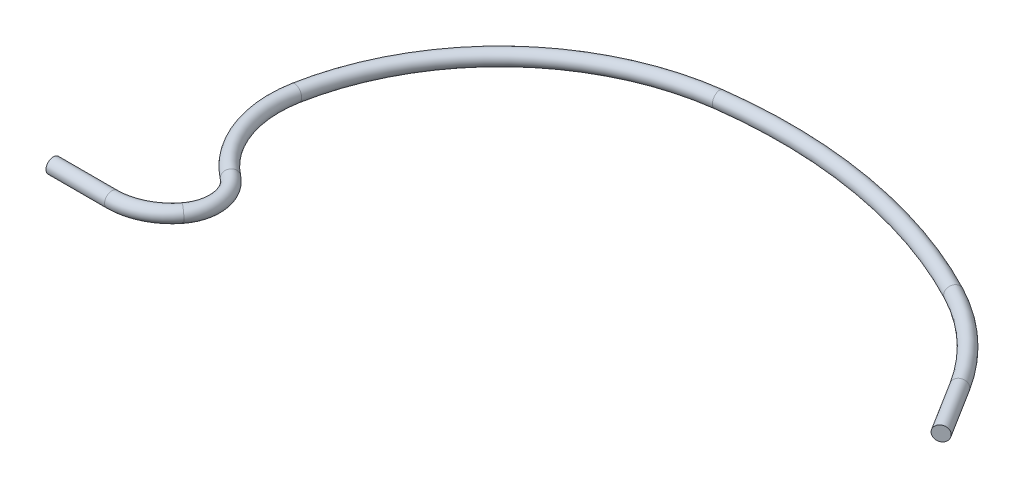
ISO-10303-21;
HEADER;
FILE_DESCRIPTION(('STEP AP214'),'2;1');
FILE_NAME('part.step','',(''),(''),'','','');
FILE_SCHEMA(('AUTOMOTIVE_DESIGN { 1 0 10303 214 1 1 1 1 }'));
ENDSEC;
DATA;
#1=APPLICATION_CONTEXT('core data for automotive mechanical design processes');
#2=APPLICATION_PROTOCOL_DEFINITION('international standard','automotive_design',2000,#1);
#3=PRODUCT_CONTEXT('',#1,'mechanical');
#4=PRODUCT('Part','Part','',(#3));
#5=PRODUCT_RELATED_PRODUCT_CATEGORY('part','',(#4));
#6=PRODUCT_DEFINITION_FORMATION('','',#4);
#7=PRODUCT_DEFINITION_CONTEXT('part definition',#1,'design');
#8=PRODUCT_DEFINITION('design','',#6,#7);
#9=PRODUCT_DEFINITION_SHAPE('','',#8);
#10=(LENGTH_UNIT() NAMED_UNIT(*) SI_UNIT(.MILLI.,.METRE.));
#11=(NAMED_UNIT(*) PLANE_ANGLE_UNIT() SI_UNIT($,.RADIAN.));
#12=(NAMED_UNIT(*) SI_UNIT($,.STERADIAN.) SOLID_ANGLE_UNIT());
#13=UNCERTAINTY_MEASURE_WITH_UNIT(LENGTH_MEASURE(1.E-05),#10,'distance_accuracy_value','');
#14=(GEOMETRIC_REPRESENTATION_CONTEXT(3) GLOBAL_UNCERTAINTY_ASSIGNED_CONTEXT((#13)) GLOBAL_UNIT_ASSIGNED_CONTEXT((#10,
#11,#12)) REPRESENTATION_CONTEXT('',''));
#15=CARTESIAN_POINT('',(0.,0.,0.));
#16=DIRECTION('',(0.,0.,1.));
#17=DIRECTION('',(1.,0.,0.));
#18=AXIS2_PLACEMENT_3D('',#15,#16,#17);
#19=CARTESIAN_POINT('',(220.163330813573,0.,-89.2265843815221));
#20=DIRECTION('',(0.530362713064288,0.,0.847770837308696));
#21=DIRECTION('',(0.847770837308696,0.,-0.530362713064288));
#22=AXIS2_PLACEMENT_3D('',#19,#20,#21);
#23=CYLINDRICAL_SURFACE('',#22,2.5);
#24=CARTESIAN_POINT('',(220.163330813573,0.,-89.2265843815221));
#25=DIRECTION('',(0.530362713064287,0.,0.847770837308697));
#26=DIRECTION('',(0.847770837308697,0.,-0.530362713064287));
#27=AXIS2_PLACEMENT_3D('',#24,#25,#26);
#28=CIRCLE('',#27,2.5);
#29=CARTESIAN_POINT('',(222.282757906845,0.,-90.5524911641829));
#30=VERTEX_POINT('',#29);
#31=EDGE_CURVE('E36',#30,#30,#28,.T.);
#32=ORIENTED_EDGE('',*,*,#31,.T.);
#33=EDGE_LOOP('',(#32));
#34=FACE_BOUND('',#33,.T.);
#35=CARTESIAN_POINT('',(230.770585074859,0.,-72.2711676353481));
#36=DIRECTION('',(0.530362713064287,0.,0.847770837308697));
#37=DIRECTION('',(0.847770837308697,0.,-0.530362713064287));
#38=AXIS2_PLACEMENT_3D('',#35,#36,#37);
#39=CIRCLE('',#38,2.5);
#40=CARTESIAN_POINT('',(232.89001216813,0.,-73.5970744180089));
#41=VERTEX_POINT('',#40);
#42=EDGE_CURVE('E10',#41,#41,#39,.T.);
#43=ORIENTED_EDGE('',*,*,#42,.F.);
#44=EDGE_LOOP('',(#43));
#45=FACE_BOUND('',#44,.T.);
#46=ADVANCED_FACE('F30',(#34,#45),#23,.T.);
#47=CARTESIAN_POINT('',(156.758398918372,0.,-49.560662623293));
#48=DIRECTION('',(0.,-1.,0.));
#49=DIRECTION('',(0.,0.,-1.));
#50=AXIS2_PLACEMENT_3D('',#47,#48,#49);
#51=TOROIDAL_SURFACE('',#50,74.7901780821856,2.5);
#52=CARTESIAN_POINT('',(191.475888413676,0.,-115.804656016721));
#53=DIRECTION('',(0.885731189470269,0.,0.464198513568906));
#54=DIRECTION('',(0.464198513568906,0.,-0.885731189470269));
#55=AXIS2_PLACEMENT_3D('',#52,#53,#54);
#56=CIRCLE('',#55,2.5);
#57=CARTESIAN_POINT('',(192.636384697598,0.,-118.018983990396));
#58=VERTEX_POINT('',#57);
#59=EDGE_CURVE('E40',#58,#58,#56,.T.);
#60=CARTESIAN_POINT('',(156.758398918372,0.,-49.560662623293));
#61=DIRECTION('',(0.,-1.,0.));
#62=DIRECTION('',(0.,0.,-1.));
#63=AXIS2_PLACEMENT_3D('',#60,#61,#62);
#64=CIRCLE('',#63,77.2901780821856);
#65=EDGE_CURVE('',#58,#30,#64,.T.);
#66=ORIENTED_EDGE('',*,*,#59,.T.);
#67=ORIENTED_EDGE('',*,*,#31,.F.);
#68=ORIENTED_EDGE('',*,*,#65,.T.);
#69=ORIENTED_EDGE('',*,*,#65,.F.);
#70=EDGE_LOOP('',(#66,#68,#67,#69));
#71=FACE_BOUND('',#70,.T.);
#72=ADVANCED_FACE('F83',(#71),#51,.T.);
#73=CARTESIAN_POINT('',(115.475901992138,0.,29.2099366740876));
#74=DIRECTION('',(0.,-1.,0.));
#75=DIRECTION('',(0.,0.,-1.));
#76=AXIS2_PLACEMENT_3D('',#73,#74,#75);
#77=TOROIDAL_SURFACE('',#76,163.723028402711,2.5);
#78=CARTESIAN_POINT('',(94.0229590846155,0.,-133.101496287246));
#79=DIRECTION('',(0.99137814970106,0.,-0.131031920902136));
#80=DIRECTION('',(-0.131031920902136,0.,-0.99137814970106));
#81=AXIS2_PLACEMENT_3D('',#78,#79,#80);
#82=CIRCLE('',#81,2.5);
#83=CARTESIAN_POINT('',(93.6953792823601,0.,-135.579941661499));
#84=VERTEX_POINT('',#83);
#85=EDGE_CURVE('E44',#84,#84,#82,.T.);
#86=CARTESIAN_POINT('',(115.475901992138,0.,29.2099366740876));
#87=DIRECTION('',(0.,-1.,0.));
#88=DIRECTION('',(0.,0.,-1.));
#89=AXIS2_PLACEMENT_3D('',#86,#87,#88);
#90=CIRCLE('',#89,166.223028402711);
#91=EDGE_CURVE('',#84,#58,#90,.T.);
#92=ORIENTED_EDGE('',*,*,#85,.T.);
#93=ORIENTED_EDGE('',*,*,#59,.F.);
#94=ORIENTED_EDGE('',*,*,#91,.T.);
#95=ORIENTED_EDGE('',*,*,#91,.F.);
#96=EDGE_LOOP('',(#92,#94,#93,#95));
#97=FACE_BOUND('',#96,.T.);
#98=ADVANCED_FACE('F87',(#97),#77,.T.);
#99=CARTESIAN_POINT('',(105.402653973409,0.,-47.0035379779801));
#100=DIRECTION('',(0.,-1.,0.));
#101=DIRECTION('',(0.,0.,-1.));
#102=AXIS2_PLACEMENT_3D('',#99,#100,#101);
#103=TOROIDAL_SURFACE('',#102,86.8467378822383,2.5);
#104=CARTESIAN_POINT('',(20.,0.,-62.7751128861587));
#105=DIRECTION('',(0.181602387064492,0.,-0.983372042012828));
#106=DIRECTION('',(-0.983372042012828,0.,-0.181602387064492));
#107=AXIS2_PLACEMENT_3D('',#104,#105,#106);
#108=CIRCLE('',#107,2.5);
#109=CARTESIAN_POINT('',(17.5415698949679,0.,-63.22911885382));
#110=VERTEX_POINT('',#109);
#111=EDGE_CURVE('E49',#110,#110,#108,.T.);
#112=CARTESIAN_POINT('',(105.402653973409,0.,-47.0035379779801));
#113=DIRECTION('',(0.,-1.,0.));
#114=DIRECTION('',(0.,0.,-1.));
#115=AXIS2_PLACEMENT_3D('',#112,#113,#114);
#116=CIRCLE('',#115,89.3467378822383);
#117=EDGE_CURVE('',#110,#84,#116,.T.);
#118=ORIENTED_EDGE('',*,*,#111,.T.);
#119=ORIENTED_EDGE('',*,*,#85,.F.);
#120=ORIENTED_EDGE('',*,*,#117,.T.);
#121=ORIENTED_EDGE('',*,*,#117,.F.);
#122=EDGE_LOOP('',(#118,#120,#119,#121));
#123=FACE_BOUND('',#122,.T.);
#124=ADVANCED_FACE('F93',(#123),#103,.T.);
#125=CARTESIAN_POINT('',(56.5066763718515,0.,-56.0333109132767));
#126=DIRECTION('',(0.,-1.,0.));
#127=DIRECTION('',(0.,0.,-1.));
#128=AXIS2_PLACEMENT_3D('',#125,#126,#127);
#129=TOROIDAL_SURFACE('',#128,37.1239722222805,2.5);
#130=CARTESIAN_POINT('',(33.7904344299797,0.,-26.6707213544691));
#131=DIRECTION('',(-0.790933399664199,0.,-0.611902244885269));
#132=DIRECTION('',(-0.611902244885269,0.,0.790933399664199));
#133=AXIS2_PLACEMENT_3D('',#130,#131,#132);
#134=CIRCLE('',#133,2.5);
#135=CARTESIAN_POINT('',(32.2606788177665,0.,-24.6933878553086));
#136=VERTEX_POINT('',#135);
#137=EDGE_CURVE('E52',#136,#136,#134,.T.);
#138=CARTESIAN_POINT('',(56.5066763718515,0.,-56.0333109132767));
#139=DIRECTION('',(0.,-1.,0.));
#140=DIRECTION('',(0.,0.,-1.));
#141=AXIS2_PLACEMENT_3D('',#138,#139,#140);
#142=CIRCLE('',#141,39.6239722222805);
#143=EDGE_CURVE('',#136,#110,#142,.T.);
#144=ORIENTED_EDGE('',*,*,#137,.T.);
#145=ORIENTED_EDGE('',*,*,#111,.F.);
#146=ORIENTED_EDGE('',*,*,#143,.T.);
#147=ORIENTED_EDGE('',*,*,#143,.F.);
#148=EDGE_LOOP('',(#144,#146,#145,#147));
#149=FACE_BOUND('',#148,.T.);
#150=ADVANCED_FACE('F100',(#149),#129,.T.);
#151=CARTESIAN_POINT('',(25.620158045293,0.,-16.109974877149));
#152=DIRECTION('',(0.,1.,0.));
#153=DIRECTION('',(0.,0.,1.));
#154=AXIS2_PLACEMENT_3D('',#151,#152,#153);
#155=TOROIDAL_SURFACE('',#154,13.3522575754214,2.5);
#156=CARTESIAN_POINT('',(36.1809045226131,0.,-7.9396984924623));
#157=DIRECTION('',(0.611902244885269,0.,-0.790933399664199));
#158=DIRECTION('',(-0.790933399664199,0.,-0.611902244885269));
#159=AXIS2_PLACEMENT_3D('',#156,#157,#158);
#160=CIRCLE('',#159,2.5);
#161=CARTESIAN_POINT('',(38.1582380217736,0.,-6.40994288024913));
#162=VERTEX_POINT('',#161);
#163=EDGE_CURVE('E55',#162,#162,#160,.T.);
#164=ORIENTED_EDGE('',*,*,#163,.T.);
#165=EDGE_LOOP('',(#164));
#166=FACE_BOUND('',#165,.T.);
#167=ORIENTED_EDGE('',*,*,#137,.F.);
#168=EDGE_LOOP('',(#167));
#169=FACE_BOUND('',#168,.T.);
#170=ADVANCED_FACE('F104',(#166,#169),#155,.T.);
#171=CARTESIAN_POINT('',(20.,0.,-20.4579861331977));
#172=DIRECTION('',(0.,1.,0.));
#173=DIRECTION('',(0.,0.,1.));
#174=AXIS2_PLACEMENT_3D('',#171,#172,#173);
#175=TOROIDAL_SURFACE('',#174,20.4579861331977,2.5);
#176=CARTESIAN_POINT('',(20.,0.,0.));
#177=DIRECTION('',(1.,0.,0.));
#178=DIRECTION('',(0.,0.,-1.));
#179=AXIS2_PLACEMENT_3D('',#176,#177,#178);
#180=CIRCLE('',#179,2.5);
#181=CARTESIAN_POINT('',(20.,0.,2.5));
#182=VERTEX_POINT('',#181);
#183=EDGE_CURVE('E58',#182,#182,#180,.T.);
#184=CARTESIAN_POINT('',(20.,0.,-20.4579861331977));
#185=DIRECTION('',(0.,1.,0.));
#186=DIRECTION('',(0.,0.,1.));
#187=AXIS2_PLACEMENT_3D('',#184,#185,#186);
#188=CIRCLE('',#187,22.9579861331977);
#189=EDGE_CURVE('',#182,#162,#188,.T.);
#190=ORIENTED_EDGE('',*,*,#183,.T.);
#191=ORIENTED_EDGE('',*,*,#163,.F.);
#192=ORIENTED_EDGE('',*,*,#189,.T.);
#193=ORIENTED_EDGE('',*,*,#189,.F.);
#194=EDGE_LOOP('',(#190,#192,#191,#193));
#195=FACE_BOUND('',#194,.T.);
#196=ADVANCED_FACE('F65',(#195),#175,.T.);
#197=CARTESIAN_POINT('',(20.,0.,0.));
#198=DIRECTION('',(-1.,0.,0.));
#199=DIRECTION('',(0.,0.,1.));
#200=AXIS2_PLACEMENT_3D('',#197,#198,#199);
#201=CYLINDRICAL_SURFACE('',#200,2.5);
#202=ORIENTED_EDGE('',*,*,#183,.F.);
#203=EDGE_LOOP('',(#202));
#204=FACE_BOUND('',#203,.T.);
#205=CARTESIAN_POINT('',(0.,0.,0.));
#206=DIRECTION('',(1.,0.,0.));
#207=DIRECTION('',(0.,0.,-1.));
#208=AXIS2_PLACEMENT_3D('',#205,#206,#207);
#209=CIRCLE('',#208,2.5);
#210=CARTESIAN_POINT('',(0.,0.,-2.5));
#211=VERTEX_POINT('',#210);
#212=EDGE_CURVE('E59',#211,#211,#209,.T.);
#213=ORIENTED_EDGE('',*,*,#212,.T.);
#214=EDGE_LOOP('',(#213));
#215=FACE_BOUND('',#214,.T.);
#216=ADVANCED_FACE('F68',(#204,#215),#201,.T.);
#217=CARTESIAN_POINT('',(230.770585074859,0.,-72.2711676353481));
#218=DIRECTION('',(0.530362713064287,0.,0.847770837308697));
#219=DIRECTION('',(0.847770837308697,0.,-0.530362713064287));
#220=AXIS2_PLACEMENT_3D('',#217,#218,#219);
#221=PLANE('',#220);
#222=ORIENTED_EDGE('',*,*,#42,.T.);
#223=EDGE_LOOP('',(#222));
#224=FACE_BOUND('',#223,.T.);
#225=ADVANCED_FACE('F71',(#224),#221,.T.);
#226=CARTESIAN_POINT('',(0.,0.,0.));
#227=DIRECTION('',(1.,0.,0.));
#228=DIRECTION('',(0.,0.,-1.));
#229=AXIS2_PLACEMENT_3D('',#226,#227,#228);
#230=PLANE('',#229);
#231=ORIENTED_EDGE('',*,*,#212,.F.);
#232=EDGE_LOOP('',(#231));
#233=FACE_BOUND('',#232,.T.);
#234=ADVANCED_FACE('F75',(#233),#230,.F.);
#235=CLOSED_SHELL('',(#46,#72,#98,#124,#150,#170,#196,#216,#225,#234));
#236=MANIFOLD_SOLID_BREP('B2',#235);
#237=ADVANCED_BREP_SHAPE_REPRESENTATION('',(#18,#236),#14);
#238=SHAPE_DEFINITION_REPRESENTATION(#9,#237);
ENDSEC;
END-ISO-10303-21;
